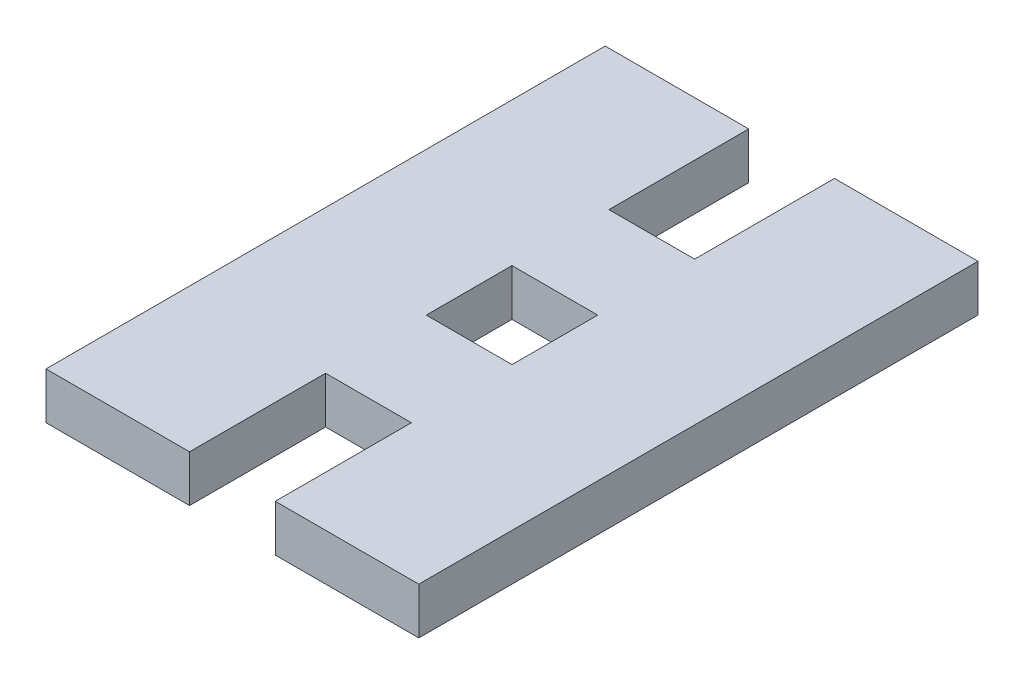
ISO-10303-21;
HEADER;
FILE_DESCRIPTION(('STEP AP214'),'2;1');
FILE_NAME('part.step','',(''),(''),'','','');
FILE_SCHEMA(('AUTOMOTIVE_DESIGN { 1 0 10303 214 1 1 1 1 }'));
ENDSEC;
DATA;
#1=APPLICATION_CONTEXT('core data for automotive mechanical design processes');
#2=APPLICATION_PROTOCOL_DEFINITION('international standard','automotive_design',2000,#1);
#3=PRODUCT_CONTEXT('',#1,'mechanical');
#4=PRODUCT('Part','Part','',(#3));
#5=PRODUCT_RELATED_PRODUCT_CATEGORY('part','',(#4));
#6=PRODUCT_DEFINITION_FORMATION('','',#4);
#7=PRODUCT_DEFINITION_CONTEXT('part definition',#1,'design');
#8=PRODUCT_DEFINITION('design','',#6,#7);
#9=PRODUCT_DEFINITION_SHAPE('','',#8);
#10=(LENGTH_UNIT() NAMED_UNIT(*) SI_UNIT(.MILLI.,.METRE.));
#11=(NAMED_UNIT(*) PLANE_ANGLE_UNIT() SI_UNIT($,.RADIAN.));
#12=(NAMED_UNIT(*) SI_UNIT($,.STERADIAN.) SOLID_ANGLE_UNIT());
#13=UNCERTAINTY_MEASURE_WITH_UNIT(LENGTH_MEASURE(1.E-05),#10,'distance_accuracy_value','');
#14=(GEOMETRIC_REPRESENTATION_CONTEXT(3) GLOBAL_UNCERTAINTY_ASSIGNED_CONTEXT((#13)) GLOBAL_UNIT_ASSIGNED_CONTEXT((#10,
#11,#12)) REPRESENTATION_CONTEXT('',''));
#15=CARTESIAN_POINT('',(0.,0.,0.));
#16=DIRECTION('',(0.,0.,1.));
#17=DIRECTION('',(1.,0.,0.));
#18=AXIS2_PLACEMENT_3D('',#15,#16,#17);
#19=CARTESIAN_POINT('',(0.,3.175,-38.1));
#20=DIRECTION('',(0.,0.,-1.));
#21=DIRECTION('',(-1.,0.,0.));
#22=AXIS2_PLACEMENT_3D('',#19,#20,#21);
#23=PLANE('',#22);
#24=DIRECTION('',(1.,0.,0.));
#25=VECTOR('',#24,1.);
#26=CARTESIAN_POINT('',(0.,0.,-38.1));
#27=LINE('',#26,#25);
#28=CARTESIAN_POINT('',(15.621,0.,-38.1));
#29=VERTEX_POINT('',#28);
#30=CARTESIAN_POINT('',(25.4,0.,-38.1));
#31=VERTEX_POINT('',#30);
#32=EDGE_CURVE('E199',#29,#31,#27,.T.);
#33=ORIENTED_EDGE('',*,*,#32,.F.);
#34=DIRECTION('',(0.,-1.,0.));
#35=VECTOR('',#34,1.);
#36=CARTESIAN_POINT('',(15.621,3.175,-38.1));
#37=LINE('',#36,#35);
#38=CARTESIAN_POINT('',(15.621,3.175,-38.1));
#39=VERTEX_POINT('',#38);
#40=EDGE_CURVE('E11',#39,#29,#37,.T.);
#41=ORIENTED_EDGE('',*,*,#40,.F.);
#42=DIRECTION('',(1.,0.,0.));
#43=VECTOR('',#42,1.);
#44=CARTESIAN_POINT('',(0.,3.175,-38.1));
#45=LINE('',#44,#43);
#46=CARTESIAN_POINT('',(25.4,3.175,-38.1));
#47=VERTEX_POINT('',#46);
#48=EDGE_CURVE('E269',#39,#47,#45,.T.);
#49=ORIENTED_EDGE('',*,*,#48,.T.);
#50=DIRECTION('',(0.,-1.,0.));
#51=VECTOR('',#50,1.);
#52=CARTESIAN_POINT('',(25.4,3.175,-38.1));
#53=LINE('',#52,#51);
#54=EDGE_CURVE('E113',#47,#31,#53,.T.);
#55=ORIENTED_EDGE('',*,*,#54,.T.);
#56=EDGE_LOOP('',(#33,#41,#49,#55));
#57=FACE_BOUND('',#56,.T.);
#58=ADVANCED_FACE('F35',(#57),#23,.T.);
#59=CARTESIAN_POINT('',(15.621,3.175,0.));
#60=DIRECTION('',(1.,0.,0.));
#61=DIRECTION('',(0.,0.,-1.));
#62=AXIS2_PLACEMENT_3D('',#59,#60,#61);
#63=PLANE('',#62);
#64=DIRECTION('',(0.,0.,1.));
#65=VECTOR('',#64,1.);
#66=CARTESIAN_POINT('',(15.621,0.,0.));
#67=LINE('',#66,#65);
#68=CARTESIAN_POINT('',(15.621,0.,-28.575));
#69=VERTEX_POINT('',#68);
#70=EDGE_CURVE('E201',#29,#69,#67,.T.);
#71=ORIENTED_EDGE('',*,*,#70,.T.);
#72=DIRECTION('',(0.,-1.,0.));
#73=VECTOR('',#72,1.);
#74=CARTESIAN_POINT('',(15.621,3.175,-28.575));
#75=LINE('',#74,#73);
#76=CARTESIAN_POINT('',(15.621,3.175,-28.575));
#77=VERTEX_POINT('',#76);
#78=EDGE_CURVE('E45',#77,#69,#75,.T.);
#79=ORIENTED_EDGE('',*,*,#78,.F.);
#80=DIRECTION('',(0.,0.,1.));
#81=VECTOR('',#80,1.);
#82=CARTESIAN_POINT('',(15.621,3.175,0.));
#83=LINE('',#82,#81);
#84=EDGE_CURVE('E272',#39,#77,#83,.T.);
#85=ORIENTED_EDGE('',*,*,#84,.F.);
#86=ORIENTED_EDGE('',*,*,#40,.T.);
#87=EDGE_LOOP('',(#71,#79,#85,#86));
#88=FACE_BOUND('',#87,.T.);
#89=ADVANCED_FACE('F306',(#88),#63,.F.);
#90=CARTESIAN_POINT('',(0.,3.175,-28.575));
#91=DIRECTION('',(0.,0.,-1.));
#92=DIRECTION('',(-1.,0.,0.));
#93=AXIS2_PLACEMENT_3D('',#90,#91,#92);
#94=PLANE('',#93);
#95=DIRECTION('',(1.,0.,0.));
#96=VECTOR('',#95,1.);
#97=CARTESIAN_POINT('',(0.,0.,-28.575));
#98=LINE('',#97,#96);
#99=CARTESIAN_POINT('',(9.779,0.,-28.575));
#100=VERTEX_POINT('',#99);
#101=EDGE_CURVE('E205',#100,#69,#98,.T.);
#102=ORIENTED_EDGE('',*,*,#101,.F.);
#103=DIRECTION('',(0.,-1.,0.));
#104=VECTOR('',#103,1.);
#105=CARTESIAN_POINT('',(9.779,3.175,-28.575));
#106=LINE('',#105,#104);
#107=CARTESIAN_POINT('',(9.779,3.175,-28.575));
#108=VERTEX_POINT('',#107);
#109=EDGE_CURVE('E242',#108,#100,#106,.T.);
#110=ORIENTED_EDGE('',*,*,#109,.F.);
#111=DIRECTION('',(1.,0.,0.));
#112=VECTOR('',#111,1.);
#113=CARTESIAN_POINT('',(0.,3.175,-28.575));
#114=LINE('',#113,#112);
#115=EDGE_CURVE('E279',#108,#77,#114,.T.);
#116=ORIENTED_EDGE('',*,*,#115,.T.);
#117=ORIENTED_EDGE('',*,*,#78,.T.);
#118=EDGE_LOOP('',(#102,#110,#116,#117));
#119=FACE_BOUND('',#118,.T.);
#120=ADVANCED_FACE('F312',(#119),#94,.T.);
#121=CARTESIAN_POINT('',(9.779,3.175,0.));
#122=DIRECTION('',(1.,0.,0.));
#123=DIRECTION('',(0.,0.,-1.));
#124=AXIS2_PLACEMENT_3D('',#121,#122,#123);
#125=PLANE('',#124);
#126=DIRECTION('',(0.,0.,1.));
#127=VECTOR('',#126,1.);
#128=CARTESIAN_POINT('',(9.779,0.,0.));
#129=LINE('',#128,#127);
#130=CARTESIAN_POINT('',(9.779,0.,-38.1));
#131=VERTEX_POINT('',#130);
#132=EDGE_CURVE('E208',#131,#100,#129,.T.);
#133=ORIENTED_EDGE('',*,*,#132,.F.);
#134=DIRECTION('',(0.,-1.,0.));
#135=VECTOR('',#134,1.);
#136=CARTESIAN_POINT('',(9.779,3.175,-38.1));
#137=LINE('',#136,#135);
#138=CARTESIAN_POINT('',(9.779,3.175,-38.1));
#139=VERTEX_POINT('',#138);
#140=EDGE_CURVE('E240',#139,#131,#137,.T.);
#141=ORIENTED_EDGE('',*,*,#140,.F.);
#142=DIRECTION('',(0.,0.,1.));
#143=VECTOR('',#142,1.);
#144=CARTESIAN_POINT('',(9.779,3.175,0.));
#145=LINE('',#144,#143);
#146=EDGE_CURVE('E282',#139,#108,#145,.T.);
#147=ORIENTED_EDGE('',*,*,#146,.T.);
#148=ORIENTED_EDGE('',*,*,#109,.T.);
#149=EDGE_LOOP('',(#133,#141,#147,#148));
#150=FACE_BOUND('',#149,.T.);
#151=ADVANCED_FACE('F319',(#150),#125,.T.);
#152=CARTESIAN_POINT('',(0.,0.,-38.1));
#153=VERTEX_POINT('',#152);
#154=EDGE_CURVE('E202',#153,#131,#27,.T.);
#155=ORIENTED_EDGE('',*,*,#154,.F.);
#156=DIRECTION('',(0.,-1.,0.));
#157=VECTOR('',#156,1.);
#158=CARTESIAN_POINT('',(0.,3.175,-38.1));
#159=LINE('',#158,#157);
#160=CARTESIAN_POINT('',(0.,3.175,-38.1));
#161=VERTEX_POINT('',#160);
#162=EDGE_CURVE('E238',#161,#153,#159,.T.);
#163=ORIENTED_EDGE('',*,*,#162,.F.);
#164=EDGE_CURVE('E274',#161,#139,#45,.T.);
#165=ORIENTED_EDGE('',*,*,#164,.T.);
#166=ORIENTED_EDGE('',*,*,#140,.T.);
#167=EDGE_LOOP('',(#155,#163,#165,#166));
#168=FACE_BOUND('',#167,.T.);
#169=ADVANCED_FACE('F308',(#168),#23,.T.);
#170=CARTESIAN_POINT('',(0.,3.175,0.));
#171=DIRECTION('',(-1.,0.,0.));
#172=DIRECTION('',(0.,0.,1.));
#173=AXIS2_PLACEMENT_3D('',#170,#171,#172);
#174=PLANE('',#173);
#175=DIRECTION('',(0.,0.,-1.));
#176=VECTOR('',#175,1.);
#177=CARTESIAN_POINT('',(0.,0.,0.));
#178=LINE('',#177,#176);
#179=CARTESIAN_POINT('',(0.,0.,0.));
#180=VERTEX_POINT('',#179);
#181=EDGE_CURVE('E211',#180,#153,#178,.T.);
#182=ORIENTED_EDGE('',*,*,#181,.F.);
#183=DIRECTION('',(0.,-1.,0.));
#184=VECTOR('',#183,1.);
#185=CARTESIAN_POINT('',(0.,3.175,0.));
#186=LINE('',#185,#184);
#187=CARTESIAN_POINT('',(0.,3.175,0.));
#188=VERTEX_POINT('',#187);
#189=EDGE_CURVE('E236',#188,#180,#186,.T.);
#190=ORIENTED_EDGE('',*,*,#189,.F.);
#191=DIRECTION('',(0.,0.,-1.));
#192=VECTOR('',#191,1.);
#193=CARTESIAN_POINT('',(0.,3.175,0.));
#194=LINE('',#193,#192);
#195=EDGE_CURVE('E285',#188,#161,#194,.T.);
#196=ORIENTED_EDGE('',*,*,#195,.T.);
#197=ORIENTED_EDGE('',*,*,#162,.T.);
#198=EDGE_LOOP('',(#182,#190,#196,#197));
#199=FACE_BOUND('',#198,.T.);
#200=ADVANCED_FACE('F318',(#199),#174,.T.);
#201=CARTESIAN_POINT('',(0.,3.175,0.));
#202=DIRECTION('',(0.,0.,-1.));
#203=DIRECTION('',(-1.,0.,0.));
#204=AXIS2_PLACEMENT_3D('',#201,#202,#203);
#205=PLANE('',#204);
#206=DIRECTION('',(1.,0.,0.));
#207=VECTOR('',#206,1.);
#208=CARTESIAN_POINT('',(0.,0.,0.));
#209=LINE('',#208,#207);
#210=CARTESIAN_POINT('',(9.779,0.,0.));
#211=VERTEX_POINT('',#210);
#212=EDGE_CURVE('E214',#180,#211,#209,.T.);
#213=ORIENTED_EDGE('',*,*,#212,.T.);
#214=DIRECTION('',(0.,-1.,0.));
#215=VECTOR('',#214,1.);
#216=CARTESIAN_POINT('',(9.779,3.175,0.));
#217=LINE('',#216,#215);
#218=CARTESIAN_POINT('',(9.779,3.175,0.));
#219=VERTEX_POINT('',#218);
#220=EDGE_CURVE('E233',#219,#211,#217,.T.);
#221=ORIENTED_EDGE('',*,*,#220,.F.);
#222=DIRECTION('',(1.,0.,0.));
#223=VECTOR('',#222,1.);
#224=CARTESIAN_POINT('',(0.,3.175,0.));
#225=LINE('',#224,#223);
#226=EDGE_CURVE('E176',#188,#219,#225,.T.);
#227=ORIENTED_EDGE('',*,*,#226,.F.);
#228=ORIENTED_EDGE('',*,*,#189,.T.);
#229=EDGE_LOOP('',(#213,#221,#227,#228));
#230=FACE_BOUND('',#229,.T.);
#231=ADVANCED_FACE('F325',(#230),#205,.F.);
#232=CARTESIAN_POINT('',(9.779,3.175,0.));
#233=DIRECTION('',(-1.,0.,0.));
#234=DIRECTION('',(0.,0.,1.));
#235=AXIS2_PLACEMENT_3D('',#232,#233,#234);
#236=PLANE('',#235);
#237=DIRECTION('',(0.,0.,-1.));
#238=VECTOR('',#237,1.);
#239=CARTESIAN_POINT('',(9.779,0.,0.));
#240=LINE('',#239,#238);
#241=CARTESIAN_POINT('',(9.779,0.,-9.271));
#242=VERTEX_POINT('',#241);
#243=EDGE_CURVE('E217',#211,#242,#240,.T.);
#244=ORIENTED_EDGE('',*,*,#243,.T.);
#245=DIRECTION('',(0.,-1.,0.));
#246=VECTOR('',#245,1.);
#247=CARTESIAN_POINT('',(9.779,3.175,-9.271));
#248=LINE('',#247,#246);
#249=CARTESIAN_POINT('',(9.779,3.175,-9.271));
#250=VERTEX_POINT('',#249);
#251=EDGE_CURVE('E230',#250,#242,#248,.T.);
#252=ORIENTED_EDGE('',*,*,#251,.F.);
#253=DIRECTION('',(0.,0.,-1.));
#254=VECTOR('',#253,1.);
#255=CARTESIAN_POINT('',(9.779,3.175,0.));
#256=LINE('',#255,#254);
#257=EDGE_CURVE('E182',#219,#250,#256,.T.);
#258=ORIENTED_EDGE('',*,*,#257,.F.);
#259=ORIENTED_EDGE('',*,*,#220,.T.);
#260=EDGE_LOOP('',(#244,#252,#258,#259));
#261=FACE_BOUND('',#260,.T.);
#262=ADVANCED_FACE('F293',(#261),#236,.F.);
#263=CARTESIAN_POINT('',(0.,3.175,-9.271));
#264=DIRECTION('',(0.,0.,-1.));
#265=DIRECTION('',(-1.,0.,0.));
#266=AXIS2_PLACEMENT_3D('',#263,#264,#265);
#267=PLANE('',#266);
#268=DIRECTION('',(1.,0.,0.));
#269=VECTOR('',#268,1.);
#270=CARTESIAN_POINT('',(0.,0.,-9.271));
#271=LINE('',#270,#269);
#272=CARTESIAN_POINT('',(15.621,0.,-9.271));
#273=VERTEX_POINT('',#272);
#274=EDGE_CURVE('E221',#242,#273,#271,.T.);
#275=ORIENTED_EDGE('',*,*,#274,.T.);
#276=DIRECTION('',(0.,-1.,0.));
#277=VECTOR('',#276,1.);
#278=CARTESIAN_POINT('',(15.621,3.175,-9.271));
#279=LINE('',#278,#277);
#280=CARTESIAN_POINT('',(15.621,3.175,-9.271));
#281=VERTEX_POINT('',#280);
#282=EDGE_CURVE('E169',#281,#273,#279,.T.);
#283=ORIENTED_EDGE('',*,*,#282,.F.);
#284=DIRECTION('',(1.,0.,0.));
#285=VECTOR('',#284,1.);
#286=CARTESIAN_POINT('',(0.,3.175,-9.271));
#287=LINE('',#286,#285);
#288=EDGE_CURVE('E179',#250,#281,#287,.T.);
#289=ORIENTED_EDGE('',*,*,#288,.F.);
#290=ORIENTED_EDGE('',*,*,#251,.T.);
#291=EDGE_LOOP('',(#275,#283,#289,#290));
#292=FACE_BOUND('',#291,.T.);
#293=ADVANCED_FACE('F295',(#292),#267,.F.);
#294=CARTESIAN_POINT('',(15.621,3.175,0.));
#295=DIRECTION('',(-1.,0.,0.));
#296=DIRECTION('',(0.,0.,1.));
#297=AXIS2_PLACEMENT_3D('',#294,#295,#296);
#298=PLANE('',#297);
#299=DIRECTION('',(0.,0.,-1.));
#300=VECTOR('',#299,1.);
#301=CARTESIAN_POINT('',(15.621,0.,0.));
#302=LINE('',#301,#300);
#303=CARTESIAN_POINT('',(15.621,0.,0.));
#304=VERTEX_POINT('',#303);
#305=EDGE_CURVE('E166',#304,#273,#302,.T.);
#306=ORIENTED_EDGE('',*,*,#305,.F.);
#307=DIRECTION('',(0.,-1.,0.));
#308=VECTOR('',#307,1.);
#309=CARTESIAN_POINT('',(15.621,3.175,0.));
#310=LINE('',#309,#308);
#311=CARTESIAN_POINT('',(15.621,3.175,0.));
#312=VERTEX_POINT('',#311);
#313=EDGE_CURVE('E160',#312,#304,#310,.T.);
#314=ORIENTED_EDGE('',*,*,#313,.F.);
#315=DIRECTION('',(0.,0.,-1.));
#316=VECTOR('',#315,1.);
#317=CARTESIAN_POINT('',(15.621,3.175,0.));
#318=LINE('',#317,#316);
#319=EDGE_CURVE('E164',#312,#281,#318,.T.);
#320=ORIENTED_EDGE('',*,*,#319,.T.);
#321=ORIENTED_EDGE('',*,*,#282,.T.);
#322=EDGE_LOOP('',(#306,#314,#320,#321));
#323=FACE_BOUND('',#322,.T.);
#324=ADVANCED_FACE('F162',(#323),#298,.T.);
#325=CARTESIAN_POINT('',(25.4,0.,0.));
#326=VERTEX_POINT('',#325);
#327=EDGE_CURVE('E218',#304,#326,#209,.T.);
#328=ORIENTED_EDGE('',*,*,#327,.T.);
#329=DIRECTION('',(0.,-1.,0.));
#330=VECTOR('',#329,1.);
#331=CARTESIAN_POINT('',(25.4,3.175,0.));
#332=LINE('',#331,#330);
#333=CARTESIAN_POINT('',(25.4,3.175,0.));
#334=VERTEX_POINT('',#333);
#335=EDGE_CURVE('E170',#334,#326,#332,.T.);
#336=ORIENTED_EDGE('',*,*,#335,.F.);
#337=EDGE_CURVE('E173',#312,#334,#225,.T.);
#338=ORIENTED_EDGE('',*,*,#337,.F.);
#339=ORIENTED_EDGE('',*,*,#313,.T.);
#340=EDGE_LOOP('',(#328,#336,#338,#339));
#341=FACE_BOUND('',#340,.T.);
#342=ADVANCED_FACE('F174',(#341),#205,.F.);
#343=CARTESIAN_POINT('',(15.621,3.175,0.));
#344=DIRECTION('',(-1.,0.,0.));
#345=DIRECTION('',(0.,0.,1.));
#346=AXIS2_PLACEMENT_3D('',#343,#344,#345);
#347=PLANE('',#346);
#348=DIRECTION('',(0.,0.,-1.));
#349=VECTOR('',#348,1.);
#350=CARTESIAN_POINT('',(15.621,0.,0.));
#351=LINE('',#350,#349);
#352=CARTESIAN_POINT('',(15.621,0.,-16.129));
#353=VERTEX_POINT('',#352);
#354=CARTESIAN_POINT('',(15.621,0.,-21.971));
#355=VERTEX_POINT('',#354);
#356=EDGE_CURVE('E188',#353,#355,#351,.T.);
#357=ORIENTED_EDGE('',*,*,#356,.F.);
#358=DIRECTION('',(0.,-1.,0.));
#359=VECTOR('',#358,1.);
#360=CARTESIAN_POINT('',(15.621,3.175,-16.129));
#361=LINE('',#360,#359);
#362=CARTESIAN_POINT('',(15.621,3.175,-16.129));
#363=VERTEX_POINT('',#362);
#364=EDGE_CURVE('E39',#363,#353,#361,.T.);
#365=ORIENTED_EDGE('',*,*,#364,.F.);
#366=DIRECTION('',(0.,0.,-1.));
#367=VECTOR('',#366,1.);
#368=CARTESIAN_POINT('',(15.621,3.175,0.));
#369=LINE('',#368,#367);
#370=CARTESIAN_POINT('',(15.621,3.175,-21.971));
#371=VERTEX_POINT('',#370);
#372=EDGE_CURVE('E226',#363,#371,#369,.T.);
#373=ORIENTED_EDGE('',*,*,#372,.T.);
#374=DIRECTION('',(0.,-1.,0.));
#375=VECTOR('',#374,1.);
#376=CARTESIAN_POINT('',(15.621,3.175,-21.971));
#377=LINE('',#376,#375);
#378=EDGE_CURVE('E187',#371,#355,#377,.T.);
#379=ORIENTED_EDGE('',*,*,#378,.T.);
#380=EDGE_LOOP('',(#357,#365,#373,#379));
#381=FACE_BOUND('',#380,.T.);
#382=ADVANCED_FACE('F37',(#381),#347,.T.);
#383=CARTESIAN_POINT('',(0.,3.175,-16.129));
#384=DIRECTION('',(0.,0.,-1.));
#385=DIRECTION('',(-1.,0.,0.));
#386=AXIS2_PLACEMENT_3D('',#383,#384,#385);
#387=PLANE('',#386);
#388=DIRECTION('',(1.,0.,0.));
#389=VECTOR('',#388,1.);
#390=CARTESIAN_POINT('',(0.,0.,-16.129));
#391=LINE('',#390,#389);
#392=CARTESIAN_POINT('',(9.779,0.,-16.129));
#393=VERTEX_POINT('',#392);
#394=EDGE_CURVE('E191',#393,#353,#391,.T.);
#395=ORIENTED_EDGE('',*,*,#394,.F.);
#396=DIRECTION('',(0.,-1.,0.));
#397=VECTOR('',#396,1.);
#398=CARTESIAN_POINT('',(9.779,3.175,-16.129));
#399=LINE('',#398,#397);
#400=CARTESIAN_POINT('',(9.779,3.175,-16.129));
#401=VERTEX_POINT('',#400);
#402=EDGE_CURVE('E248',#401,#393,#399,.T.);
#403=ORIENTED_EDGE('',*,*,#402,.F.);
#404=DIRECTION('',(1.,0.,0.));
#405=VECTOR('',#404,1.);
#406=CARTESIAN_POINT('',(0.,3.175,-16.129));
#407=LINE('',#406,#405);
#408=EDGE_CURVE('E257',#401,#363,#407,.T.);
#409=ORIENTED_EDGE('',*,*,#408,.T.);
#410=ORIENTED_EDGE('',*,*,#364,.T.);
#411=EDGE_LOOP('',(#395,#403,#409,#410));
#412=FACE_BOUND('',#411,.T.);
#413=ADVANCED_FACE('F255',(#412),#387,.T.);
#414=CARTESIAN_POINT('',(9.779,3.175,0.));
#415=DIRECTION('',(-1.,0.,0.));
#416=DIRECTION('',(0.,0.,1.));
#417=AXIS2_PLACEMENT_3D('',#414,#415,#416);
#418=PLANE('',#417);
#419=DIRECTION('',(0.,0.,-1.));
#420=VECTOR('',#419,1.);
#421=CARTESIAN_POINT('',(9.779,0.,0.));
#422=LINE('',#421,#420);
#423=CARTESIAN_POINT('',(9.779,0.,-21.971));
#424=VERTEX_POINT('',#423);
#425=EDGE_CURVE('E194',#393,#424,#422,.T.);
#426=ORIENTED_EDGE('',*,*,#425,.T.);
#427=DIRECTION('',(0.,-1.,0.));
#428=VECTOR('',#427,1.);
#429=CARTESIAN_POINT('',(9.779,3.175,-21.971));
#430=LINE('',#429,#428);
#431=CARTESIAN_POINT('',(9.779,3.175,-21.971));
#432=VERTEX_POINT('',#431);
#433=EDGE_CURVE('E246',#432,#424,#430,.T.);
#434=ORIENTED_EDGE('',*,*,#433,.F.);
#435=DIRECTION('',(0.,0.,-1.));
#436=VECTOR('',#435,1.);
#437=CARTESIAN_POINT('',(9.779,3.175,0.));
#438=LINE('',#437,#436);
#439=EDGE_CURVE('E270',#401,#432,#438,.T.);
#440=ORIENTED_EDGE('',*,*,#439,.F.);
#441=ORIENTED_EDGE('',*,*,#402,.T.);
#442=EDGE_LOOP('',(#426,#434,#440,#441));
#443=FACE_BOUND('',#442,.T.);
#444=ADVANCED_FACE('F263',(#443),#418,.F.);
#445=CARTESIAN_POINT('',(0.,3.175,-21.971));
#446=DIRECTION('',(0.,0.,-1.));
#447=DIRECTION('',(-1.,0.,0.));
#448=AXIS2_PLACEMENT_3D('',#445,#446,#447);
#449=PLANE('',#448);
#450=DIRECTION('',(1.,0.,0.));
#451=VECTOR('',#450,1.);
#452=CARTESIAN_POINT('',(0.,0.,-21.971));
#453=LINE('',#452,#451);
#454=EDGE_CURVE('E196',#424,#355,#453,.T.);
#455=ORIENTED_EDGE('',*,*,#454,.T.);
#456=ORIENTED_EDGE('',*,*,#378,.F.);
#457=DIRECTION('',(1.,0.,0.));
#458=VECTOR('',#457,1.);
#459=CARTESIAN_POINT('',(0.,3.175,-21.971));
#460=LINE('',#459,#458);
#461=EDGE_CURVE('E267',#432,#371,#460,.T.);
#462=ORIENTED_EDGE('',*,*,#461,.F.);
#463=ORIENTED_EDGE('',*,*,#433,.T.);
#464=EDGE_LOOP('',(#455,#456,#462,#463));
#465=FACE_BOUND('',#464,.T.);
#466=ADVANCED_FACE('F266',(#465),#449,.F.);
#467=CARTESIAN_POINT('',(25.4,3.175,0.));
#468=DIRECTION('',(-1.,0.,0.));
#469=DIRECTION('',(0.,0.,1.));
#470=AXIS2_PLACEMENT_3D('',#467,#468,#469);
#471=PLANE('',#470);
#472=DIRECTION('',(0.,0.,-1.));
#473=VECTOR('',#472,1.);
#474=CARTESIAN_POINT('',(25.4,0.,0.));
#475=LINE('',#474,#473);
#476=EDGE_CURVE('E106',#326,#31,#475,.T.);
#477=ORIENTED_EDGE('',*,*,#476,.T.);
#478=ORIENTED_EDGE('',*,*,#54,.F.);
#479=DIRECTION('',(0.,0.,-1.));
#480=VECTOR('',#479,1.);
#481=CARTESIAN_POINT('',(25.4,3.175,0.));
#482=LINE('',#481,#480);
#483=EDGE_CURVE('E54',#334,#47,#482,.T.);
#484=ORIENTED_EDGE('',*,*,#483,.F.);
#485=ORIENTED_EDGE('',*,*,#335,.T.);
#486=EDGE_LOOP('',(#477,#478,#484,#485));
#487=FACE_BOUND('',#486,.T.);
#488=ADVANCED_FACE('F302',(#487),#471,.F.);
#489=CARTESIAN_POINT('',(0.,3.175,0.));
#490=DIRECTION('',(0.,1.,0.));
#491=DIRECTION('',(0.,0.,1.));
#492=AXIS2_PLACEMENT_3D('',#489,#490,#491);
#493=PLANE('',#492);
#494=ORIENTED_EDGE('',*,*,#372,.F.);
#495=ORIENTED_EDGE('',*,*,#408,.F.);
#496=ORIENTED_EDGE('',*,*,#439,.T.);
#497=ORIENTED_EDGE('',*,*,#461,.T.);
#498=EDGE_LOOP('',(#494,#495,#496,#497));
#499=FACE_BOUND('',#498,.T.);
#500=ORIENTED_EDGE('',*,*,#48,.F.);
#501=ORIENTED_EDGE('',*,*,#84,.T.);
#502=ORIENTED_EDGE('',*,*,#115,.F.);
#503=ORIENTED_EDGE('',*,*,#146,.F.);
#504=ORIENTED_EDGE('',*,*,#164,.F.);
#505=ORIENTED_EDGE('',*,*,#195,.F.);
#506=ORIENTED_EDGE('',*,*,#226,.T.);
#507=ORIENTED_EDGE('',*,*,#257,.T.);
#508=ORIENTED_EDGE('',*,*,#288,.T.);
#509=ORIENTED_EDGE('',*,*,#319,.F.);
#510=ORIENTED_EDGE('',*,*,#337,.T.);
#511=ORIENTED_EDGE('',*,*,#483,.T.);
#512=EDGE_LOOP('',(#500,#501,#502,#503,#504,#505,#506,#507,#508,#509,#510,#511));
#513=FACE_BOUND('',#512,.T.);
#514=ADVANCED_FACE('F177',(#499,#513),#493,.T.);
#515=CARTESIAN_POINT('',(0.,0.,0.));
#516=DIRECTION('',(0.,1.,0.));
#517=DIRECTION('',(0.,0.,1.));
#518=AXIS2_PLACEMENT_3D('',#515,#516,#517);
#519=PLANE('',#518);
#520=ORIENTED_EDGE('',*,*,#356,.T.);
#521=ORIENTED_EDGE('',*,*,#454,.F.);
#522=ORIENTED_EDGE('',*,*,#425,.F.);
#523=ORIENTED_EDGE('',*,*,#394,.T.);
#524=EDGE_LOOP('',(#520,#521,#522,#523));
#525=FACE_BOUND('',#524,.T.);
#526=ORIENTED_EDGE('',*,*,#32,.T.);
#527=ORIENTED_EDGE('',*,*,#476,.F.);
#528=ORIENTED_EDGE('',*,*,#327,.F.);
#529=ORIENTED_EDGE('',*,*,#305,.T.);
#530=ORIENTED_EDGE('',*,*,#274,.F.);
#531=ORIENTED_EDGE('',*,*,#243,.F.);
#532=ORIENTED_EDGE('',*,*,#212,.F.);
#533=ORIENTED_EDGE('',*,*,#181,.T.);
#534=ORIENTED_EDGE('',*,*,#154,.T.);
#535=ORIENTED_EDGE('',*,*,#132,.T.);
#536=ORIENTED_EDGE('',*,*,#101,.T.);
#537=ORIENTED_EDGE('',*,*,#70,.F.);
#538=EDGE_LOOP('',(#526,#527,#528,#529,#530,#531,#532,#533,#534,#535,#536,#537));
#539=FACE_BOUND('',#538,.T.);
#540=ADVANCED_FACE('F261',(#525,#539),#519,.F.);
#541=CLOSED_SHELL('',(#58,#89,#120,#151,#169,#200,#231,#262,#293,#324,#342,#382,#413,#444,#466,
#488,#514,#540));
#542=MANIFOLD_SOLID_BREP('B2',#541);
#543=ADVANCED_BREP_SHAPE_REPRESENTATION('',(#18,#542),#14);
#544=SHAPE_DEFINITION_REPRESENTATION(#9,#543);
ENDSEC;
END-ISO-10303-21;
